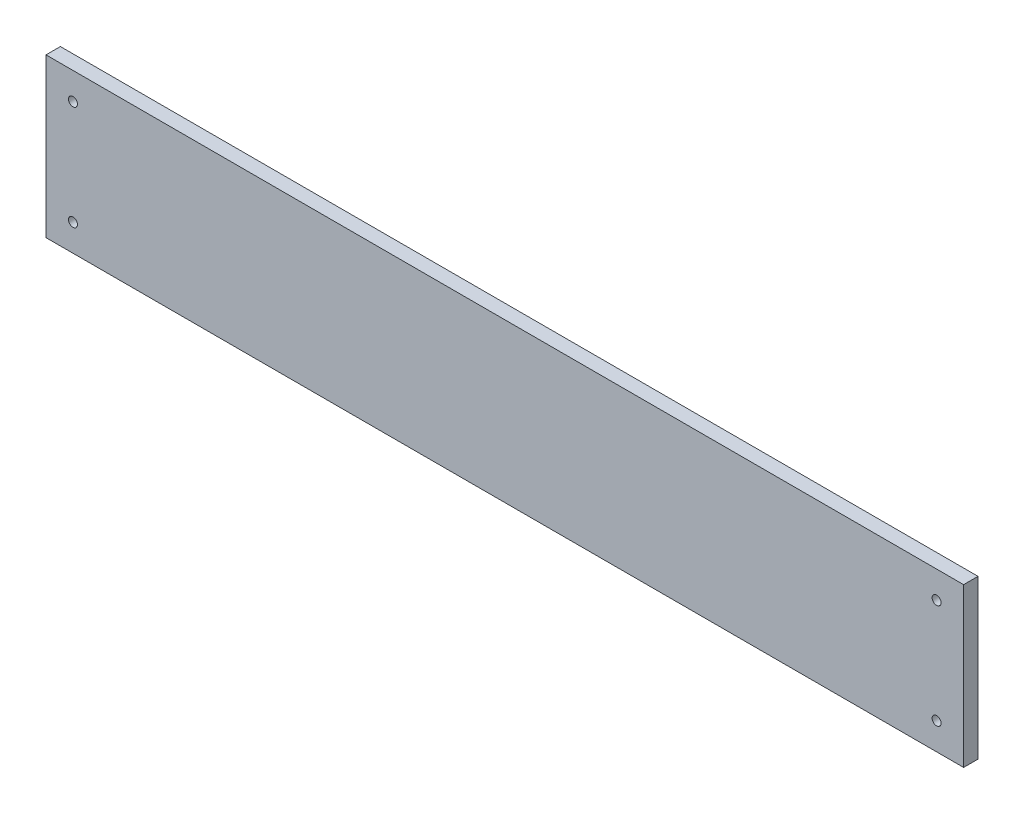
ISO-10303-21;
HEADER;
FILE_DESCRIPTION(('STEP AP214'),'2;1');
FILE_NAME('part.step','',(''),(''),'','','');
FILE_SCHEMA(('AUTOMOTIVE_DESIGN { 1 0 10303 214 1 1 1 1 }'));
ENDSEC;
DATA;
#1=APPLICATION_CONTEXT('core data for automotive mechanical design processes');
#2=APPLICATION_PROTOCOL_DEFINITION('international standard','automotive_design',2000,#1);
#3=PRODUCT_CONTEXT('',#1,'mechanical');
#4=PRODUCT('Part','Part','',(#3));
#5=PRODUCT_RELATED_PRODUCT_CATEGORY('part','',(#4));
#6=PRODUCT_DEFINITION_FORMATION('','',#4);
#7=PRODUCT_DEFINITION_CONTEXT('part definition',#1,'design');
#8=PRODUCT_DEFINITION('design','',#6,#7);
#9=PRODUCT_DEFINITION_SHAPE('','',#8);
#10=(LENGTH_UNIT() NAMED_UNIT(*) SI_UNIT(.MILLI.,.METRE.));
#11=(NAMED_UNIT(*) PLANE_ANGLE_UNIT() SI_UNIT($,.RADIAN.));
#12=(NAMED_UNIT(*) SI_UNIT($,.STERADIAN.) SOLID_ANGLE_UNIT());
#13=UNCERTAINTY_MEASURE_WITH_UNIT(LENGTH_MEASURE(1.E-05),#10,'distance_accuracy_value','');
#14=(GEOMETRIC_REPRESENTATION_CONTEXT(3) GLOBAL_UNCERTAINTY_ASSIGNED_CONTEXT((#13)) GLOBAL_UNIT_ASSIGNED_CONTEXT((#10,
#11,#12)) REPRESENTATION_CONTEXT('',''));
#15=CARTESIAN_POINT('',(0.,0.,0.));
#16=DIRECTION('',(0.,0.,1.));
#17=DIRECTION('',(1.,0.,0.));
#18=AXIS2_PLACEMENT_3D('',#15,#16,#17);
#19=CARTESIAN_POINT('',(0.,0.,243.205));
#20=DIRECTION('',(0.,0.,-1.));
#21=DIRECTION('',(-1.,0.,0.));
#22=AXIS2_PLACEMENT_3D('',#19,#20,#21);
#23=PLANE('',#22);
#24=DIRECTION('',(0.,1.,0.));
#25=VECTOR('',#24,1.);
#26=CARTESIAN_POINT('',(161.925,85.09,243.205));
#27=LINE('',#26,#25);
#28=CARTESIAN_POINT('',(161.925,85.09,243.205));
#29=VERTEX_POINT('',#28);
#30=CARTESIAN_POINT('',(161.925,140.97,243.205));
#31=VERTEX_POINT('',#30);
#32=EDGE_CURVE('E85',#29,#31,#27,.T.);
#33=ORIENTED_EDGE('',*,*,#32,.T.);
#34=DIRECTION('',(-1.,0.,0.));
#35=VECTOR('',#34,1.);
#36=CARTESIAN_POINT('',(-161.925,140.97,243.205));
#37=LINE('',#36,#35);
#38=CARTESIAN_POINT('',(-161.925,140.97,243.205));
#39=VERTEX_POINT('',#38);
#40=EDGE_CURVE('E80',#31,#39,#37,.T.);
#41=ORIENTED_EDGE('',*,*,#40,.T.);
#42=DIRECTION('',(0.,-1.,0.));
#43=VECTOR('',#42,1.);
#44=CARTESIAN_POINT('',(-161.925,85.09,243.205));
#45=LINE('',#44,#43);
#46=CARTESIAN_POINT('',(-161.925,85.09,243.205));
#47=VERTEX_POINT('',#46);
#48=EDGE_CURVE('E83',#39,#47,#45,.T.);
#49=ORIENTED_EDGE('',*,*,#48,.T.);
#50=DIRECTION('',(1.,0.,0.));
#51=VECTOR('',#50,1.);
#52=CARTESIAN_POINT('',(-161.925,85.09,243.205));
#53=LINE('',#52,#51);
#54=EDGE_CURVE('E50',#47,#29,#53,.T.);
#55=ORIENTED_EDGE('',*,*,#54,.T.);
#56=EDGE_LOOP('',(#33,#41,#49,#55));
#57=FACE_BOUND('',#56,.T.);
#58=CARTESIAN_POINT('',(-152.4,131.445,243.205));
#59=DIRECTION('',(0.,0.,1.));
#60=DIRECTION('',(1.,0.,0.));
#61=AXIS2_PLACEMENT_3D('',#58,#59,#60);
#62=CIRCLE('',#61,1.58749999999999);
#63=CARTESIAN_POINT('',(-150.8125,131.445,243.205));
#64=VERTEX_POINT('',#63);
#65=EDGE_CURVE('E100',#64,#64,#62,.T.);
#66=ORIENTED_EDGE('',*,*,#65,.F.);
#67=EDGE_LOOP('',(#66));
#68=FACE_BOUND('',#67,.T.);
#69=CARTESIAN_POINT('',(152.4,131.445,243.205));
#70=DIRECTION('',(0.,0.,1.));
#71=DIRECTION('',(1.,0.,0.));
#72=AXIS2_PLACEMENT_3D('',#69,#70,#71);
#73=CIRCLE('',#72,1.58749999999999);
#74=CARTESIAN_POINT('',(153.9875,131.445,243.205));
#75=VERTEX_POINT('',#74);
#76=EDGE_CURVE('E115',#75,#75,#73,.T.);
#77=ORIENTED_EDGE('',*,*,#76,.F.);
#78=EDGE_LOOP('',(#77));
#79=FACE_BOUND('',#78,.T.);
#80=CARTESIAN_POINT('',(152.4,94.6150000000001,243.205));
#81=DIRECTION('',(0.,0.,1.));
#82=DIRECTION('',(1.,0.,0.));
#83=AXIS2_PLACEMENT_3D('',#80,#81,#82);
#84=CIRCLE('',#83,1.58749999999999);
#85=CARTESIAN_POINT('',(153.9875,94.6150000000001,243.205));
#86=VERTEX_POINT('',#85);
#87=EDGE_CURVE('E121',#86,#86,#84,.T.);
#88=ORIENTED_EDGE('',*,*,#87,.F.);
#89=EDGE_LOOP('',(#88));
#90=FACE_BOUND('',#89,.T.);
#91=CARTESIAN_POINT('',(-152.399999999999,94.6150000000001,243.205));
#92=DIRECTION('',(0.,0.,1.));
#93=DIRECTION('',(1.,0.,0.));
#94=AXIS2_PLACEMENT_3D('',#91,#92,#93);
#95=CIRCLE('',#94,1.58749999999999);
#96=CARTESIAN_POINT('',(-150.812499999999,94.6150000000001,243.205));
#97=VERTEX_POINT('',#96);
#98=EDGE_CURVE('E127',#97,#97,#95,.T.);
#99=ORIENTED_EDGE('',*,*,#98,.F.);
#100=EDGE_LOOP('',(#99));
#101=FACE_BOUND('',#100,.T.);
#102=ADVANCED_FACE('F33',(#57,#68,#79,#90,#101),#23,.F.);
#103=CARTESIAN_POINT('',(0.,0.,238.125));
#104=DIRECTION('',(0.,0.,-1.));
#105=DIRECTION('',(-1.,0.,0.));
#106=AXIS2_PLACEMENT_3D('',#103,#104,#105);
#107=PLANE('',#106);
#108=CARTESIAN_POINT('',(152.4,94.6150000000001,238.125));
#109=DIRECTION('',(0.,0.,1.));
#110=DIRECTION('',(1.,0.,0.));
#111=AXIS2_PLACEMENT_3D('',#108,#109,#110);
#112=CIRCLE('',#111,1.58749999999999);
#113=CARTESIAN_POINT('',(153.9875,94.6150000000001,238.125));
#114=VERTEX_POINT('',#113);
#115=EDGE_CURVE('E124',#114,#114,#112,.T.);
#116=ORIENTED_EDGE('',*,*,#115,.T.);
#117=EDGE_LOOP('',(#116));
#118=FACE_BOUND('',#117,.T.);
#119=CARTESIAN_POINT('',(-152.4,131.445,238.125));
#120=DIRECTION('',(0.,0.,1.));
#121=DIRECTION('',(1.,0.,0.));
#122=AXIS2_PLACEMENT_3D('',#119,#120,#121);
#123=CIRCLE('',#122,1.58749999999999);
#124=CARTESIAN_POINT('',(-150.8125,131.445,238.125));
#125=VERTEX_POINT('',#124);
#126=EDGE_CURVE('E112',#125,#125,#123,.T.);
#127=ORIENTED_EDGE('',*,*,#126,.T.);
#128=EDGE_LOOP('',(#127));
#129=FACE_BOUND('',#128,.T.);
#130=DIRECTION('',(0.,1.,0.));
#131=VECTOR('',#130,1.);
#132=CARTESIAN_POINT('',(161.925,85.09,238.125));
#133=LINE('',#132,#131);
#134=CARTESIAN_POINT('',(161.925,85.09,238.125));
#135=VERTEX_POINT('',#134);
#136=CARTESIAN_POINT('',(161.925,140.97,238.125));
#137=VERTEX_POINT('',#136);
#138=EDGE_CURVE('E97',#135,#137,#133,.T.);
#139=ORIENTED_EDGE('',*,*,#138,.F.);
#140=DIRECTION('',(1.,0.,0.));
#141=VECTOR('',#140,1.);
#142=CARTESIAN_POINT('',(-161.925,85.09,238.125));
#143=LINE('',#142,#141);
#144=CARTESIAN_POINT('',(-161.925,85.09,238.125));
#145=VERTEX_POINT('',#144);
#146=EDGE_CURVE('E73',#145,#135,#143,.T.);
#147=ORIENTED_EDGE('',*,*,#146,.F.);
#148=DIRECTION('',(0.,-1.,0.));
#149=VECTOR('',#148,1.);
#150=CARTESIAN_POINT('',(-161.925,85.09,238.125));
#151=LINE('',#150,#149);
#152=CARTESIAN_POINT('',(-161.925,140.97,238.125));
#153=VERTEX_POINT('',#152);
#154=EDGE_CURVE('E67',#153,#145,#151,.T.);
#155=ORIENTED_EDGE('',*,*,#154,.F.);
#156=DIRECTION('',(-1.,0.,0.));
#157=VECTOR('',#156,1.);
#158=CARTESIAN_POINT('',(-161.925,140.97,238.125));
#159=LINE('',#158,#157);
#160=EDGE_CURVE('E89',#137,#153,#159,.T.);
#161=ORIENTED_EDGE('',*,*,#160,.F.);
#162=EDGE_LOOP('',(#139,#147,#155,#161));
#163=FACE_BOUND('',#162,.T.);
#164=CARTESIAN_POINT('',(152.4,131.445,238.125));
#165=DIRECTION('',(0.,0.,1.));
#166=DIRECTION('',(1.,0.,0.));
#167=AXIS2_PLACEMENT_3D('',#164,#165,#166);
#168=CIRCLE('',#167,1.58749999999999);
#169=CARTESIAN_POINT('',(153.9875,131.445,238.125));
#170=VERTEX_POINT('',#169);
#171=EDGE_CURVE('E118',#170,#170,#168,.T.);
#172=ORIENTED_EDGE('',*,*,#171,.T.);
#173=EDGE_LOOP('',(#172));
#174=FACE_BOUND('',#173,.T.);
#175=CARTESIAN_POINT('',(-152.399999999999,94.6150000000001,238.125));
#176=DIRECTION('',(0.,0.,1.));
#177=DIRECTION('',(1.,0.,0.));
#178=AXIS2_PLACEMENT_3D('',#175,#176,#177);
#179=CIRCLE('',#178,1.58749999999999);
#180=CARTESIAN_POINT('',(-150.812499999999,94.6150000000001,238.125));
#181=VERTEX_POINT('',#180);
#182=EDGE_CURVE('E130',#181,#181,#179,.T.);
#183=ORIENTED_EDGE('',*,*,#182,.T.);
#184=EDGE_LOOP('',(#183));
#185=FACE_BOUND('',#184,.T.);
#186=ADVANCED_FACE('F108',(#118,#129,#163,#174,#185),#107,.T.);
#187=CARTESIAN_POINT('',(161.925,85.09,243.205));
#188=DIRECTION('',(-1.,0.,0.));
#189=DIRECTION('',(0.,0.,1.));
#190=AXIS2_PLACEMENT_3D('',#187,#188,#189);
#191=PLANE('',#190);
#192=ORIENTED_EDGE('',*,*,#138,.T.);
#193=DIRECTION('',(0.,0.,-1.));
#194=VECTOR('',#193,1.);
#195=CARTESIAN_POINT('',(161.925,140.97,243.205));
#196=LINE('',#195,#194);
#197=EDGE_CURVE('E11',#31,#137,#196,.T.);
#198=ORIENTED_EDGE('',*,*,#197,.F.);
#199=ORIENTED_EDGE('',*,*,#32,.F.);
#200=DIRECTION('',(0.,0.,-1.));
#201=VECTOR('',#200,1.);
#202=CARTESIAN_POINT('',(161.925,85.09,243.205));
#203=LINE('',#202,#201);
#204=EDGE_CURVE('E93',#29,#135,#203,.T.);
#205=ORIENTED_EDGE('',*,*,#204,.T.);
#206=EDGE_LOOP('',(#192,#198,#199,#205));
#207=FACE_BOUND('',#206,.T.);
#208=ADVANCED_FACE('F35',(#207),#191,.F.);
#209=CARTESIAN_POINT('',(-161.925,140.97,243.205));
#210=DIRECTION('',(0.,-1.,0.));
#211=DIRECTION('',(0.,0.,-1.));
#212=AXIS2_PLACEMENT_3D('',#209,#210,#211);
#213=PLANE('',#212);
#214=ORIENTED_EDGE('',*,*,#160,.T.);
#215=DIRECTION('',(0.,0.,-1.));
#216=VECTOR('',#215,1.);
#217=CARTESIAN_POINT('',(-161.925,140.97,243.205));
#218=LINE('',#217,#216);
#219=EDGE_CURVE('E42',#39,#153,#218,.T.);
#220=ORIENTED_EDGE('',*,*,#219,.F.);
#221=ORIENTED_EDGE('',*,*,#40,.F.);
#222=ORIENTED_EDGE('',*,*,#197,.T.);
#223=EDGE_LOOP('',(#214,#220,#221,#222));
#224=FACE_BOUND('',#223,.T.);
#225=ADVANCED_FACE('F88',(#224),#213,.F.);
#226=CARTESIAN_POINT('',(-161.925,85.09,243.205));
#227=DIRECTION('',(1.,0.,0.));
#228=DIRECTION('',(0.,0.,-1.));
#229=AXIS2_PLACEMENT_3D('',#226,#227,#228);
#230=PLANE('',#229);
#231=ORIENTED_EDGE('',*,*,#154,.T.);
#232=DIRECTION('',(0.,0.,-1.));
#233=VECTOR('',#232,1.);
#234=CARTESIAN_POINT('',(-161.925,85.09,243.205));
#235=LINE('',#234,#233);
#236=EDGE_CURVE('E90',#47,#145,#235,.T.);
#237=ORIENTED_EDGE('',*,*,#236,.F.);
#238=ORIENTED_EDGE('',*,*,#48,.F.);
#239=ORIENTED_EDGE('',*,*,#219,.T.);
#240=EDGE_LOOP('',(#231,#237,#238,#239));
#241=FACE_BOUND('',#240,.T.);
#242=ADVANCED_FACE('F91',(#241),#230,.F.);
#243=CARTESIAN_POINT('',(-161.925,85.09,243.205));
#244=DIRECTION('',(0.,1.,0.));
#245=DIRECTION('',(-1.,0.,0.));
#246=AXIS2_PLACEMENT_3D('',#243,#244,#245);
#247=PLANE('',#246);
#248=ORIENTED_EDGE('',*,*,#146,.T.);
#249=ORIENTED_EDGE('',*,*,#204,.F.);
#250=ORIENTED_EDGE('',*,*,#54,.F.);
#251=ORIENTED_EDGE('',*,*,#236,.T.);
#252=EDGE_LOOP('',(#248,#249,#250,#251));
#253=FACE_BOUND('',#252,.T.);
#254=ADVANCED_FACE('F105',(#253),#247,.F.);
#255=CARTESIAN_POINT('',(-152.4,131.445,243.205));
#256=DIRECTION('',(0.,0.,-1.));
#257=DIRECTION('',(-1.,0.,0.));
#258=AXIS2_PLACEMENT_3D('',#255,#256,#257);
#259=CYLINDRICAL_SURFACE('',#258,1.58749999999999);
#260=ORIENTED_EDGE('',*,*,#65,.T.);
#261=EDGE_LOOP('',(#260));
#262=FACE_BOUND('',#261,.T.);
#263=ORIENTED_EDGE('',*,*,#126,.F.);
#264=EDGE_LOOP('',(#263));
#265=FACE_BOUND('',#264,.T.);
#266=ADVANCED_FACE('F147',(#262,#265),#259,.F.);
#267=CARTESIAN_POINT('',(152.4,131.445,243.205));
#268=DIRECTION('',(0.,0.,-1.));
#269=DIRECTION('',(-1.,0.,0.));
#270=AXIS2_PLACEMENT_3D('',#267,#268,#269);
#271=CYLINDRICAL_SURFACE('',#270,1.58749999999999);
#272=ORIENTED_EDGE('',*,*,#76,.T.);
#273=EDGE_LOOP('',(#272));
#274=FACE_BOUND('',#273,.T.);
#275=ORIENTED_EDGE('',*,*,#171,.F.);
#276=EDGE_LOOP('',(#275));
#277=FACE_BOUND('',#276,.T.);
#278=ADVANCED_FACE('F192',(#274,#277),#271,.F.);
#279=CARTESIAN_POINT('',(152.4,94.6150000000001,243.205));
#280=DIRECTION('',(0.,0.,-1.));
#281=DIRECTION('',(-1.,0.,0.));
#282=AXIS2_PLACEMENT_3D('',#279,#280,#281);
#283=CYLINDRICAL_SURFACE('',#282,1.58749999999999);
#284=ORIENTED_EDGE('',*,*,#87,.T.);
#285=EDGE_LOOP('',(#284));
#286=FACE_BOUND('',#285,.T.);
#287=ORIENTED_EDGE('',*,*,#115,.F.);
#288=EDGE_LOOP('',(#287));
#289=FACE_BOUND('',#288,.T.);
#290=ADVANCED_FACE('F200',(#286,#289),#283,.F.);
#291=CARTESIAN_POINT('',(-152.399999999999,94.6150000000001,243.205));
#292=DIRECTION('',(0.,0.,-1.));
#293=DIRECTION('',(-1.,0.,0.));
#294=AXIS2_PLACEMENT_3D('',#291,#292,#293);
#295=CYLINDRICAL_SURFACE('',#294,1.58749999999999);
#296=ORIENTED_EDGE('',*,*,#98,.T.);
#297=EDGE_LOOP('',(#296));
#298=FACE_BOUND('',#297,.T.);
#299=ORIENTED_EDGE('',*,*,#182,.F.);
#300=EDGE_LOOP('',(#299));
#301=FACE_BOUND('',#300,.T.);
#302=ADVANCED_FACE('F136',(#298,#301),#295,.F.);
#303=CLOSED_SHELL('',(#102,#186,#208,#225,#242,#254,#266,#278,#290,#302));
#304=MANIFOLD_SOLID_BREP('B2',#303);
#305=ADVANCED_BREP_SHAPE_REPRESENTATION('',(#18,#304),#14);
#306=SHAPE_DEFINITION_REPRESENTATION(#9,#305);
ENDSEC;
END-ISO-10303-21;
